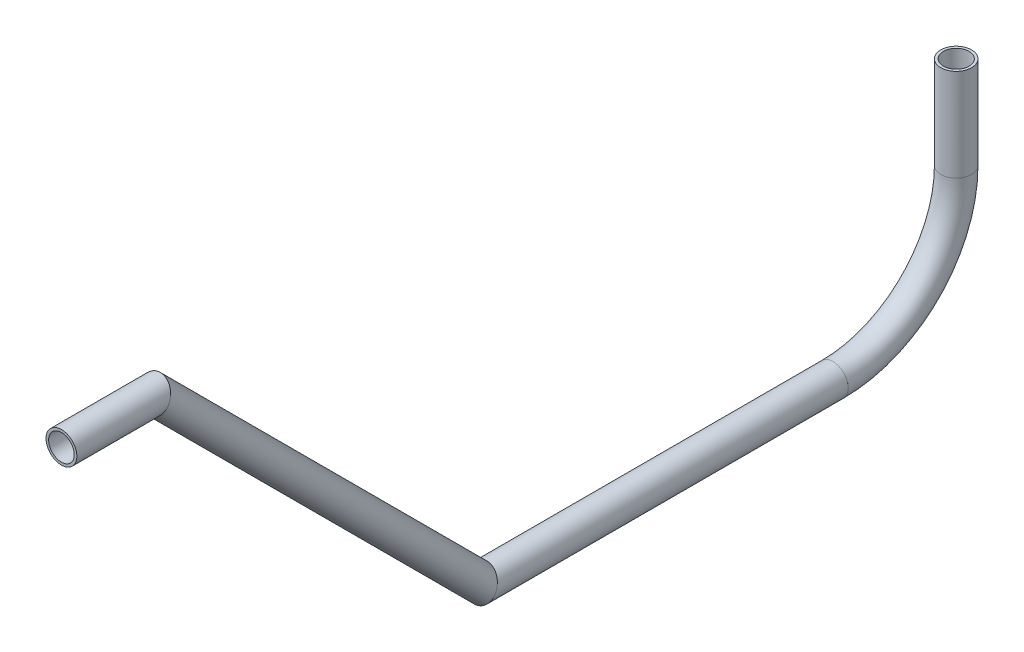
ISO-10303-21;
HEADER;
FILE_DESCRIPTION(('STEP AP214'),'2;1');
FILE_NAME('part.step','',(''),(''),'','','');
FILE_SCHEMA(('AUTOMOTIVE_DESIGN { 1 0 10303 214 1 1 1 1 }'));
ENDSEC;
DATA;
#1=APPLICATION_CONTEXT('core data for automotive mechanical design processes');
#2=APPLICATION_PROTOCOL_DEFINITION('international standard','automotive_design',2000,#1);
#3=PRODUCT_CONTEXT('',#1,'mechanical');
#4=PRODUCT('Part','Part','',(#3));
#5=PRODUCT_RELATED_PRODUCT_CATEGORY('part','',(#4));
#6=PRODUCT_DEFINITION_FORMATION('','',#4);
#7=PRODUCT_DEFINITION_CONTEXT('part definition',#1,'design');
#8=PRODUCT_DEFINITION('design','',#6,#7);
#9=PRODUCT_DEFINITION_SHAPE('','',#8);
#10=(LENGTH_UNIT() NAMED_UNIT(*) SI_UNIT(.MILLI.,.METRE.));
#11=(NAMED_UNIT(*) PLANE_ANGLE_UNIT() SI_UNIT($,.RADIAN.));
#12=(NAMED_UNIT(*) SI_UNIT($,.STERADIAN.) SOLID_ANGLE_UNIT());
#13=UNCERTAINTY_MEASURE_WITH_UNIT(LENGTH_MEASURE(1.E-05),#10,'distance_accuracy_value','');
#14=(GEOMETRIC_REPRESENTATION_CONTEXT(3) GLOBAL_UNCERTAINTY_ASSIGNED_CONTEXT((#13)) GLOBAL_UNIT_ASSIGNED_CONTEXT((#10,
#11,#12)) REPRESENTATION_CONTEXT('',''));
#15=CARTESIAN_POINT('',(0.,0.,0.));
#16=DIRECTION('',(0.,0.,1.));
#17=DIRECTION('',(1.,0.,0.));
#18=AXIS2_PLACEMENT_3D('',#15,#16,#17);
#19=CARTESIAN_POINT('',(0.,599.763297601191,265.49304431159));
#20=DIRECTION('',(0.,0.,1.));
#21=DIRECTION('',(1.,0.,0.));
#22=AXIS2_PLACEMENT_3D('',#19,#20,#21);
#23=CYLINDRICAL_SURFACE('',#22,5.28320000000004);
#24=CARTESIAN_POINT('',(0.,599.763297601191,303.59304431159));
#25=DIRECTION('',(0.,0.,-1.));
#26=DIRECTION('',(-1.,0.,0.));
#27=AXIS2_PLACEMENT_3D('',#24,#25,#26);
#28=CIRCLE('',#27,5.28320000000004);
#29=CARTESIAN_POINT('',(-5.28320000000004,599.763297601191,303.59304431159));
#30=VERTEX_POINT('',#29);
#31=EDGE_CURVE('E54',#30,#30,#28,.T.);
#32=ORIENTED_EDGE('',*,*,#31,.F.);
#33=EDGE_LOOP('',(#32));
#34=FACE_BOUND('',#33,.T.);
#35=CARTESIAN_POINT('',(0.,599.763297601191,265.49304431159));
#36=DIRECTION('',(0.,-0.38268343236509,-0.923879532511287));
#37=DIRECTION('',(0.,-0.923879532511287,0.38268343236509));
#38=AXIS2_PLACEMENT_3D('',#35,#36,#37);
#39=ELLIPSE('',#38,5.71849447258482,5.28320000000004);
#40=CARTESIAN_POINT('',(0.,594.480097601191,267.68141740432));
#41=VERTEX_POINT('',#40);
#42=EDGE_CURVE('E50',#41,#41,#39,.T.);
#43=ORIENTED_EDGE('',*,*,#42,.T.);
#44=EDGE_LOOP('',(#43));
#45=FACE_BOUND('',#44,.T.);
#46=ADVANCED_FACE('F46',(#34,#45),#23,.F.);
#47=CARTESIAN_POINT('',(0.,599.763297601191,265.49304431159));
#48=DIRECTION('',(0.,0.,1.));
#49=DIRECTION('',(1.,0.,0.));
#50=AXIS2_PLACEMENT_3D('',#47,#48,#49);
#51=CYLINDRICAL_SURFACE('',#50,6.35000000000005);
#52=CARTESIAN_POINT('',(0.,599.763297601191,303.59304431159));
#53=DIRECTION('',(0.,0.,-1.));
#54=DIRECTION('',(-1.,0.,0.));
#55=AXIS2_PLACEMENT_3D('',#52,#53,#54);
#56=CIRCLE('',#55,6.35000000000005);
#57=CARTESIAN_POINT('',(-6.35000000000005,599.763297601191,303.59304431159));
#58=VERTEX_POINT('',#57);
#59=EDGE_CURVE('E58',#58,#58,#56,.T.);
#60=ORIENTED_EDGE('',*,*,#59,.T.);
#61=EDGE_LOOP('',(#60));
#62=FACE_BOUND('',#61,.T.);
#63=CARTESIAN_POINT('',(0.,599.763297601191,265.49304431159));
#64=DIRECTION('',(0.,-0.38268343236509,-0.923879532511287));
#65=DIRECTION('',(0.,-0.923879532511287,0.38268343236509));
#66=AXIS2_PLACEMENT_3D('',#63,#64,#65);
#67=ELLIPSE('',#66,6.87319047185676,6.35000000000005);
#68=CARTESIAN_POINT('',(0.,593.413297601191,268.123300432659));
#69=VERTEX_POINT('',#68);
#70=EDGE_CURVE('E12',#69,#69,#67,.T.);
#71=ORIENTED_EDGE('',*,*,#70,.F.);
#72=EDGE_LOOP('',(#71));
#73=FACE_BOUND('',#72,.T.);
#74=ADVANCED_FACE('F73',(#62,#73),#51,.T.);
#75=CARTESIAN_POINT('',(0.,599.763297601191,303.59304431159));
#76=DIRECTION('',(0.,0.,-1.));
#77=DIRECTION('',(-1.,0.,0.));
#78=AXIS2_PLACEMENT_3D('',#75,#76,#77);
#79=PLANE('',#78);
#80=ORIENTED_EDGE('',*,*,#31,.T.);
#81=EDGE_LOOP('',(#80));
#82=FACE_BOUND('',#81,.T.);
#83=ORIENTED_EDGE('',*,*,#59,.F.);
#84=EDGE_LOOP('',(#83));
#85=FACE_BOUND('',#84,.T.);
#86=ADVANCED_FACE('F69',(#82,#85),#79,.F.);
#87=CARTESIAN_POINT('',(0.,599.763297601191,265.49304431159));
#88=DIRECTION('',(0.,-0.38268343236509,-0.923879532511287));
#89=DIRECTION('',(0.,0.923879532511287,-0.38268343236509));
#90=AXIS2_PLACEMENT_3D('',#87,#88,#89);
#91=PLANE('',#90);
#92=ORIENTED_EDGE('',*,*,#42,.F.);
#93=EDGE_LOOP('',(#92));
#94=FACE_BOUND('',#93,.T.);
#95=ORIENTED_EDGE('',*,*,#70,.T.);
#96=EDGE_LOOP('',(#95));
#97=FACE_BOUND('',#96,.T.);
#98=ADVANCED_FACE('F48',(#94,#97),#91,.T.);
#99=CLOSED_SHELL('',(#46,#74,#86,#98));
#100=MANIFOLD_SOLID_BREP('B2',#99);
#101=CARTESIAN_POINT('',(0.,465.192951173248,130.922697883648));
#102=DIRECTION('',(0.,0.707106781186549,0.707106781186546));
#103=DIRECTION('',(0.,-0.707106781186546,0.707106781186549));
#104=AXIS2_PLACEMENT_3D('',#101,#102,#103);
#105=CYLINDRICAL_SURFACE('',#104,5.28320000000004);
#106=CARTESIAN_POINT('',(0.,465.192951173248,130.922697883648));
#107=DIRECTION('',(0.,-0.382683432365091,-0.923879532511286));
#108=DIRECTION('',(0.,0.923879532511287,-0.382683432365091));
#109=AXIS2_PLACEMENT_3D('',#106,#107,#108);
#110=ELLIPSE('',#109,5.71849447258482,5.28320000000004);
#111=CARTESIAN_POINT('',(0.,470.476151173248,128.734324790918));
#112=VERTEX_POINT('',#111);
#113=EDGE_CURVE('E150',#112,#112,#110,.T.);
#114=ORIENTED_EDGE('',*,*,#113,.T.);
#115=EDGE_LOOP('',(#114));
#116=FACE_BOUND('',#115,.T.);
#117=CARTESIAN_POINT('',(0.,599.763297601191,265.49304431159));
#118=DIRECTION('',(0.,0.382683432365091,0.923879532511286));
#119=DIRECTION('',(0.,0.923879532511287,-0.382683432365091));
#120=AXIS2_PLACEMENT_3D('',#117,#118,#119);
#121=ELLIPSE('',#120,5.71849447258482,5.28320000000004);
#122=CARTESIAN_POINT('',(0.,605.046497601191,263.304671218861));
#123=VERTEX_POINT('',#122);
#124=EDGE_CURVE('E140',#123,#123,#121,.T.);
#125=ORIENTED_EDGE('',*,*,#124,.T.);
#126=EDGE_LOOP('',(#125));
#127=FACE_BOUND('',#126,.T.);
#128=ADVANCED_FACE('F136',(#116,#127),#105,.F.);
#129=CARTESIAN_POINT('',(0.,465.192951173248,130.922697883648));
#130=DIRECTION('',(0.,0.707106781186549,0.707106781186546));
#131=DIRECTION('',(0.,-0.707106781186546,0.707106781186549));
#132=AXIS2_PLACEMENT_3D('',#129,#130,#131);
#133=CYLINDRICAL_SURFACE('',#132,6.35000000000005);
#134=CARTESIAN_POINT('',(0.,465.192951173248,130.922697883648));
#135=DIRECTION('',(0.,-0.382683432365091,-0.923879532511286));
#136=DIRECTION('',(0.,0.923879532511287,-0.382683432365091));
#137=AXIS2_PLACEMENT_3D('',#134,#135,#136);
#138=ELLIPSE('',#137,6.87319047185676,6.35000000000005);
#139=CARTESIAN_POINT('',(0.,471.542951173248,128.292441762579));
#140=VERTEX_POINT('',#139);
#141=EDGE_CURVE('E144',#140,#140,#138,.T.);
#142=ORIENTED_EDGE('',*,*,#141,.F.);
#143=EDGE_LOOP('',(#142));
#144=FACE_BOUND('',#143,.T.);
#145=CARTESIAN_POINT('',(0.,599.763297601191,265.49304431159));
#146=DIRECTION('',(0.,0.382683432365091,0.923879532511286));
#147=DIRECTION('',(0.,0.923879532511287,-0.382683432365091));
#148=AXIS2_PLACEMENT_3D('',#145,#146,#147);
#149=ELLIPSE('',#148,6.87319047185676,6.35000000000005);
#150=CARTESIAN_POINT('',(0.,606.113297601191,262.862788190521));
#151=VERTEX_POINT('',#150);
#152=EDGE_CURVE('E45',#151,#151,#149,.T.);
#153=ORIENTED_EDGE('',*,*,#152,.F.);
#154=EDGE_LOOP('',(#153));
#155=FACE_BOUND('',#154,.T.);
#156=ADVANCED_FACE('F163',(#144,#155),#133,.T.);
#157=CARTESIAN_POINT('',(0.,465.192951173248,130.922697883648));
#158=DIRECTION('',(0.,-0.382683432365091,-0.923879532511286));
#159=DIRECTION('',(0.,0.923879532511287,-0.382683432365091));
#160=AXIS2_PLACEMENT_3D('',#157,#158,#159);
#161=PLANE('',#160);
#162=ORIENTED_EDGE('',*,*,#113,.F.);
#163=EDGE_LOOP('',(#162));
#164=FACE_BOUND('',#163,.T.);
#165=ORIENTED_EDGE('',*,*,#141,.T.);
#166=EDGE_LOOP('',(#165));
#167=FACE_BOUND('',#166,.T.);
#168=ADVANCED_FACE('F159',(#164,#167),#161,.T.);
#169=CARTESIAN_POINT('',(0.,599.763297601191,265.49304431159));
#170=DIRECTION('',(0.,0.382683432365091,0.923879532511286));
#171=DIRECTION('',(0.,-0.923879532511287,0.382683432365091));
#172=AXIS2_PLACEMENT_3D('',#169,#170,#171);
#173=PLANE('',#172);
#174=ORIENTED_EDGE('',*,*,#124,.F.);
#175=EDGE_LOOP('',(#174));
#176=FACE_BOUND('',#175,.T.);
#177=ORIENTED_EDGE('',*,*,#152,.T.);
#178=EDGE_LOOP('',(#177));
#179=FACE_BOUND('',#178,.T.);
#180=ADVANCED_FACE('F138',(#176,#179),#173,.T.);
#181=CLOSED_SHELL('',(#128,#156,#168,#180));
#182=MANIFOLD_SOLID_BREP('B7',#181);
#183=CARTESIAN_POINT('',(0.,465.192951173248,-14.1198122468133));
#184=DIRECTION('',(0.,0.,1.));
#185=DIRECTION('',(1.,0.,0.));
#186=AXIS2_PLACEMENT_3D('',#183,#184,#185);
#187=CYLINDRICAL_SURFACE('',#186,5.28320000000004);
#188=CARTESIAN_POINT('',(0.,465.192951173248,-14.1198122468133));
#189=DIRECTION('',(0.,0.,-1.));
#190=DIRECTION('',(-1.,0.,0.));
#191=AXIS2_PLACEMENT_3D('',#188,#189,#190);
#192=CIRCLE('',#191,5.28320000000004);
#193=CARTESIAN_POINT('',(-5.28320000000004,465.192951173248,-14.1198122468133));
#194=VERTEX_POINT('',#193);
#195=EDGE_CURVE('E242',#194,#194,#192,.T.);
#196=ORIENTED_EDGE('',*,*,#195,.T.);
#197=EDGE_LOOP('',(#196));
#198=FACE_BOUND('',#197,.T.);
#199=CARTESIAN_POINT('',(0.,465.192951173248,130.922697883648));
#200=DIRECTION('',(0.,0.38268343236509,0.923879532511287));
#201=DIRECTION('',(0.,-0.923879532511287,0.38268343236509));
#202=AXIS2_PLACEMENT_3D('',#199,#200,#201);
#203=ELLIPSE('',#202,5.71849447258482,5.28320000000004);
#204=CARTESIAN_POINT('',(0.,459.909751173248,133.111070976377));
#205=VERTEX_POINT('',#204);
#206=EDGE_CURVE('E232',#205,#205,#203,.T.);
#207=ORIENTED_EDGE('',*,*,#206,.T.);
#208=EDGE_LOOP('',(#207));
#209=FACE_BOUND('',#208,.T.);
#210=ADVANCED_FACE('F228',(#198,#209),#187,.F.);
#211=CARTESIAN_POINT('',(0.,465.192951173248,-14.1198122468133));
#212=DIRECTION('',(0.,0.,1.));
#213=DIRECTION('',(1.,0.,0.));
#214=AXIS2_PLACEMENT_3D('',#211,#212,#213);
#215=CYLINDRICAL_SURFACE('',#214,6.35000000000005);
#216=CARTESIAN_POINT('',(0.,465.192951173248,-14.1198122468133));
#217=DIRECTION('',(0.,0.,-1.));
#218=DIRECTION('',(-1.,0.,0.));
#219=AXIS2_PLACEMENT_3D('',#216,#217,#218);
#220=CIRCLE('',#219,6.35000000000005);
#221=CARTESIAN_POINT('',(-6.35000000000005,465.192951173248,-14.1198122468133));
#222=VERTEX_POINT('',#221);
#223=EDGE_CURVE('E236',#222,#222,#220,.T.);
#224=ORIENTED_EDGE('',*,*,#223,.F.);
#225=EDGE_LOOP('',(#224));
#226=FACE_BOUND('',#225,.T.);
#227=CARTESIAN_POINT('',(0.,465.192951173248,130.922697883648));
#228=DIRECTION('',(0.,0.38268343236509,0.923879532511287));
#229=DIRECTION('',(0.,-0.923879532511287,0.38268343236509));
#230=AXIS2_PLACEMENT_3D('',#227,#228,#229);
#231=ELLIPSE('',#230,6.87319047185676,6.35000000000005);
#232=CARTESIAN_POINT('',(0.,458.842951173248,133.552954004717));
#233=VERTEX_POINT('',#232);
#234=EDGE_CURVE('E135',#233,#233,#231,.T.);
#235=ORIENTED_EDGE('',*,*,#234,.F.);
#236=EDGE_LOOP('',(#235));
#237=FACE_BOUND('',#236,.T.);
#238=ADVANCED_FACE('F255',(#226,#237),#215,.T.);
#239=CARTESIAN_POINT('',(0.,465.192951173248,-14.1198122468133));
#240=DIRECTION('',(0.,0.,-1.));
#241=DIRECTION('',(-1.,0.,0.));
#242=AXIS2_PLACEMENT_3D('',#239,#240,#241);
#243=PLANE('',#242);
#244=ORIENTED_EDGE('',*,*,#195,.F.);
#245=EDGE_LOOP('',(#244));
#246=FACE_BOUND('',#245,.T.);
#247=ORIENTED_EDGE('',*,*,#223,.T.);
#248=EDGE_LOOP('',(#247));
#249=FACE_BOUND('',#248,.T.);
#250=ADVANCED_FACE('F251',(#246,#249),#243,.T.);
#251=CARTESIAN_POINT('',(0.,465.192951173248,130.922697883648));
#252=DIRECTION('',(0.,0.38268343236509,0.923879532511287));
#253=DIRECTION('',(0.,-0.923879532511287,0.38268343236509));
#254=AXIS2_PLACEMENT_3D('',#251,#252,#253);
#255=PLANE('',#254);
#256=ORIENTED_EDGE('',*,*,#206,.F.);
#257=EDGE_LOOP('',(#256));
#258=FACE_BOUND('',#257,.T.);
#259=ORIENTED_EDGE('',*,*,#234,.T.);
#260=EDGE_LOOP('',(#259));
#261=FACE_BOUND('',#260,.T.);
#262=ADVANCED_FACE('F230',(#258,#261),#255,.T.);
#263=CLOSED_SHELL('',(#210,#238,#250,#262));
#264=MANIFOLD_SOLID_BREP('B40',#263);
#265=CARTESIAN_POINT('',(0.,515.992951173248,-14.1198122468133));
#266=DIRECTION('',(-1.,0.,0.));
#267=DIRECTION('',(0.,0.,1.));
#268=AXIS2_PLACEMENT_3D('',#265,#266,#267);
#269=TOROIDAL_SURFACE('',#268,50.8000000000002,5.28320000000004);
#270=CARTESIAN_POINT('',(0.,515.992951173248,-64.9198122468135));
#271=DIRECTION('',(0.,1.,0.));
#272=DIRECTION('',(0.,0.,1.));
#273=AXIS2_PLACEMENT_3D('',#270,#271,#272);
#274=CIRCLE('',#273,5.28320000000004);
#275=CARTESIAN_POINT('',(0.,515.992951173248,-70.2030122468136));
#276=VERTEX_POINT('',#275);
#277=EDGE_CURVE('E333',#276,#276,#274,.T.);
#278=CARTESIAN_POINT('',(0.,465.192951173247,-14.1198122468133));
#279=DIRECTION('',(0.,0.,1.));
#280=DIRECTION('',(1.,0.,0.));
#281=AXIS2_PLACEMENT_3D('',#278,#279,#280);
#282=CIRCLE('',#281,5.28320000000004);
#283=CARTESIAN_POINT('',(0.,459.909751173247,-14.1198122468133));
#284=VERTEX_POINT('',#283);
#285=EDGE_CURVE('E323',#284,#284,#282,.T.);
#286=CARTESIAN_POINT('',(0.,515.992951173248,-14.1198122468133));
#287=DIRECTION('',(-1.,0.,0.));
#288=DIRECTION('',(0.,0.,1.));
#289=AXIS2_PLACEMENT_3D('',#286,#287,#288);
#290=CIRCLE('',#289,56.0832000000003);
#291=EDGE_CURVE('',#276,#284,#290,.T.);
#292=ORIENTED_EDGE('',*,*,#277,.T.);
#293=ORIENTED_EDGE('',*,*,#285,.T.);
#294=ORIENTED_EDGE('',*,*,#291,.T.);
#295=ORIENTED_EDGE('',*,*,#291,.F.);
#296=EDGE_LOOP('',(#292,#294,#293,#295));
#297=FACE_BOUND('',#296,.T.);
#298=ADVANCED_FACE('F319',(#297),#269,.F.);
#299=CARTESIAN_POINT('',(0.,515.992951173248,-14.1198122468133));
#300=DIRECTION('',(-1.,0.,0.));
#301=DIRECTION('',(0.,0.,1.));
#302=AXIS2_PLACEMENT_3D('',#299,#300,#301);
#303=TOROIDAL_SURFACE('',#302,50.8000000000002,6.35000000000005);
#304=CARTESIAN_POINT('',(0.,515.992951173248,-64.9198122468135));
#305=DIRECTION('',(0.,1.,0.));
#306=DIRECTION('',(0.,0.,1.));
#307=AXIS2_PLACEMENT_3D('',#304,#305,#306);
#308=CIRCLE('',#307,6.35000000000005);
#309=CARTESIAN_POINT('',(0.,515.992951173248,-71.2698122468136));
#310=VERTEX_POINT('',#309);
#311=EDGE_CURVE('E327',#310,#310,#308,.T.);
#312=CARTESIAN_POINT('',(0.,465.192951173247,-14.1198122468133));
#313=DIRECTION('',(0.,0.,1.));
#314=DIRECTION('',(1.,0.,0.));
#315=AXIS2_PLACEMENT_3D('',#312,#313,#314);
#316=CIRCLE('',#315,6.35000000000005);
#317=CARTESIAN_POINT('',(0.,458.842951173247,-14.1198122468133));
#318=VERTEX_POINT('',#317);
#319=EDGE_CURVE('E227',#318,#318,#316,.T.);
#320=CARTESIAN_POINT('',(0.,515.992951173248,-14.1198122468133));
#321=DIRECTION('',(-1.,0.,0.));
#322=DIRECTION('',(0.,0.,1.));
#323=AXIS2_PLACEMENT_3D('',#320,#321,#322);
#324=CIRCLE('',#323,57.1500000000003);
#325=EDGE_CURVE('',#310,#318,#324,.T.);
#326=ORIENTED_EDGE('',*,*,#311,.F.);
#327=ORIENTED_EDGE('',*,*,#319,.F.);
#328=ORIENTED_EDGE('',*,*,#325,.T.);
#329=ORIENTED_EDGE('',*,*,#325,.F.);
#330=EDGE_LOOP('',(#326,#328,#327,#329));
#331=FACE_BOUND('',#330,.T.);
#332=ADVANCED_FACE('F346',(#331),#303,.T.);
#333=CARTESIAN_POINT('',(0.,515.992951173248,-64.9198122468133));
#334=DIRECTION('',(0.,1.,0.));
#335=DIRECTION('',(0.,0.,1.));
#336=AXIS2_PLACEMENT_3D('',#333,#334,#335);
#337=PLANE('',#336);
#338=ORIENTED_EDGE('',*,*,#277,.F.);
#339=EDGE_LOOP('',(#338));
#340=FACE_BOUND('',#339,.T.);
#341=ORIENTED_EDGE('',*,*,#311,.T.);
#342=EDGE_LOOP('',(#341));
#343=FACE_BOUND('',#342,.T.);
#344=ADVANCED_FACE('F342',(#340,#343),#337,.T.);
#345=CARTESIAN_POINT('',(0.,465.192951173248,-14.1198122468133));
#346=DIRECTION('',(0.,0.,1.));
#347=DIRECTION('',(1.,0.,0.));
#348=AXIS2_PLACEMENT_3D('',#345,#346,#347);
#349=PLANE('',#348);
#350=ORIENTED_EDGE('',*,*,#285,.F.);
#351=EDGE_LOOP('',(#350));
#352=FACE_BOUND('',#351,.T.);
#353=ORIENTED_EDGE('',*,*,#319,.T.);
#354=EDGE_LOOP('',(#353));
#355=FACE_BOUND('',#354,.T.);
#356=ADVANCED_FACE('F321',(#352,#355),#349,.T.);
#357=CLOSED_SHELL('',(#298,#332,#344,#356));
#358=MANIFOLD_SOLID_BREP('B130',#357);
#359=CARTESIAN_POINT('',(0.,554.092951173248,-64.9198122468135));
#360=DIRECTION('',(0.,-1.,0.));
#361=DIRECTION('',(0.,0.,-1.));
#362=AXIS2_PLACEMENT_3D('',#359,#360,#361);
#363=CYLINDRICAL_SURFACE('',#362,5.28320000000004);
#364=CARTESIAN_POINT('',(0.,554.092951173248,-64.9198122468135));
#365=DIRECTION('',(0.,1.,0.));
#366=DIRECTION('',(-1.,0.,0.));
#367=AXIS2_PLACEMENT_3D('',#364,#365,#366);
#368=CIRCLE('',#367,5.28320000000004);
#369=CARTESIAN_POINT('',(-5.28320000000004,554.092951173248,-64.9198122468135));
#370=VERTEX_POINT('',#369);
#371=EDGE_CURVE('E417',#370,#370,#368,.T.);
#372=ORIENTED_EDGE('',*,*,#371,.T.);
#373=EDGE_LOOP('',(#372));
#374=FACE_BOUND('',#373,.T.);
#375=CARTESIAN_POINT('',(0.,515.992951173248,-64.9198122468135));
#376=DIRECTION('',(0.,-1.,0.));
#377=DIRECTION('',(0.,0.,-1.));
#378=AXIS2_PLACEMENT_3D('',#375,#376,#377);
#379=CIRCLE('',#378,5.28320000000004);
#380=CARTESIAN_POINT('',(0.,515.992951173248,-70.2030122468136));
#381=VERTEX_POINT('',#380);
#382=EDGE_CURVE('E407',#381,#381,#379,.T.);
#383=ORIENTED_EDGE('',*,*,#382,.T.);
#384=EDGE_LOOP('',(#383));
#385=FACE_BOUND('',#384,.T.);
#386=ADVANCED_FACE('F403',(#374,#385),#363,.F.);
#387=CARTESIAN_POINT('',(0.,554.092951173248,-64.9198122468135));
#388=DIRECTION('',(0.,-1.,0.));
#389=DIRECTION('',(0.,0.,-1.));
#390=AXIS2_PLACEMENT_3D('',#387,#388,#389);
#391=CYLINDRICAL_SURFACE('',#390,6.35000000000005);
#392=CARTESIAN_POINT('',(0.,554.092951173248,-64.9198122468135));
#393=DIRECTION('',(0.,1.,0.));
#394=DIRECTION('',(-1.,0.,0.));
#395=AXIS2_PLACEMENT_3D('',#392,#393,#394);
#396=CIRCLE('',#395,6.35000000000005);
#397=CARTESIAN_POINT('',(-6.35000000000005,554.092951173248,-64.9198122468135));
#398=VERTEX_POINT('',#397);
#399=EDGE_CURVE('E411',#398,#398,#396,.T.);
#400=ORIENTED_EDGE('',*,*,#399,.F.);
#401=EDGE_LOOP('',(#400));
#402=FACE_BOUND('',#401,.T.);
#403=CARTESIAN_POINT('',(0.,515.992951173248,-64.9198122468135));
#404=DIRECTION('',(0.,-1.,0.));
#405=DIRECTION('',(0.,0.,-1.));
#406=AXIS2_PLACEMENT_3D('',#403,#404,#405);
#407=CIRCLE('',#406,6.35000000000005);
#408=CARTESIAN_POINT('',(0.,515.992951173248,-71.2698122468136));
#409=VERTEX_POINT('',#408);
#410=EDGE_CURVE('E318',#409,#409,#407,.T.);
#411=ORIENTED_EDGE('',*,*,#410,.F.);
#412=EDGE_LOOP('',(#411));
#413=FACE_BOUND('',#412,.T.);
#414=ADVANCED_FACE('F430',(#402,#413),#391,.T.);
#415=CARTESIAN_POINT('',(0.,554.092951173248,-64.9198122468135));
#416=DIRECTION('',(0.,1.,0.));
#417=DIRECTION('',(-1.,0.,0.));
#418=AXIS2_PLACEMENT_3D('',#415,#416,#417);
#419=PLANE('',#418);
#420=ORIENTED_EDGE('',*,*,#371,.F.);
#421=EDGE_LOOP('',(#420));
#422=FACE_BOUND('',#421,.T.);
#423=ORIENTED_EDGE('',*,*,#399,.T.);
#424=EDGE_LOOP('',(#423));
#425=FACE_BOUND('',#424,.T.);
#426=ADVANCED_FACE('F426',(#422,#425),#419,.T.);
#427=CARTESIAN_POINT('',(0.,515.992951173248,-64.9198122468133));
#428=DIRECTION('',(0.,-1.,0.));
#429=DIRECTION('',(0.,0.,-1.));
#430=AXIS2_PLACEMENT_3D('',#427,#428,#429);
#431=PLANE('',#430);
#432=ORIENTED_EDGE('',*,*,#382,.F.);
#433=EDGE_LOOP('',(#432));
#434=FACE_BOUND('',#433,.T.);
#435=ORIENTED_EDGE('',*,*,#410,.T.);
#436=EDGE_LOOP('',(#435));
#437=FACE_BOUND('',#436,.T.);
#438=ADVANCED_FACE('F405',(#434,#437),#431,.T.);
#439=CLOSED_SHELL('',(#386,#414,#426,#438));
#440=MANIFOLD_SOLID_BREP('B222',#439);
#441=ADVANCED_BREP_SHAPE_REPRESENTATION('',(#18,#100,#182,#264,#358,#440),#14);
#442=SHAPE_DEFINITION_REPRESENTATION(#9,#441);
ENDSEC;
END-ISO-10303-21;
